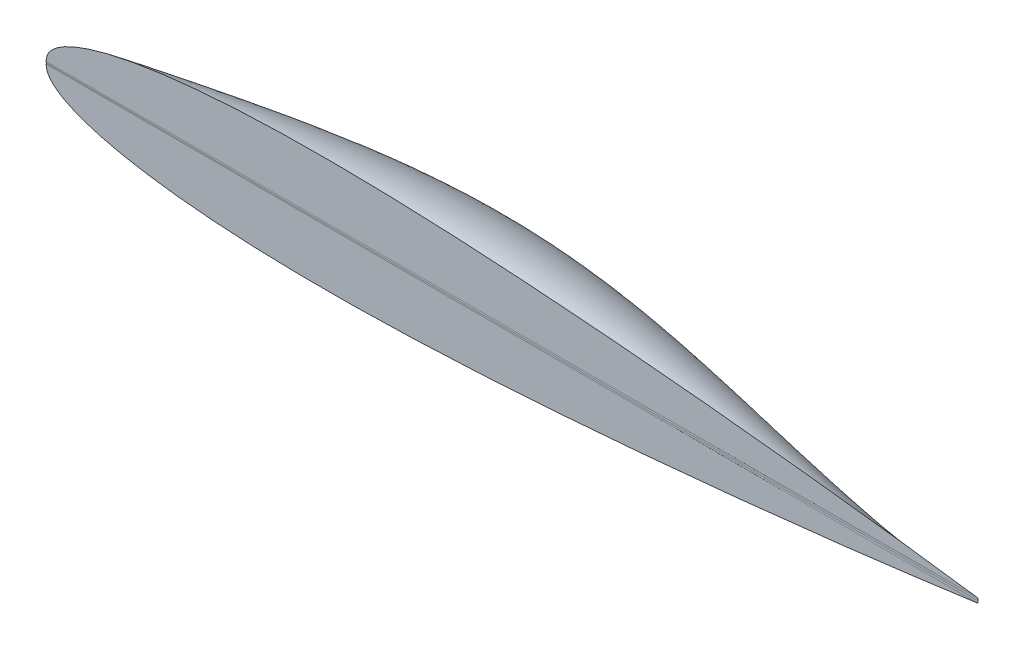
ISO-10303-21;
HEADER;
FILE_DESCRIPTION(('STEP AP214'),'2;1');
FILE_NAME('part.step','',(''),(''),'','','');
FILE_SCHEMA(('AUTOMOTIVE_DESIGN { 1 0 10303 214 1 1 1 1 }'));
ENDSEC;
DATA;
#1=APPLICATION_CONTEXT('core data for automotive mechanical design processes');
#2=APPLICATION_PROTOCOL_DEFINITION('international standard','automotive_design',2000,#1);
#3=PRODUCT_CONTEXT('',#1,'mechanical');
#4=PRODUCT('Part','Part','',(#3));
#5=PRODUCT_RELATED_PRODUCT_CATEGORY('part','',(#4));
#6=PRODUCT_DEFINITION_FORMATION('','',#4);
#7=PRODUCT_DEFINITION_CONTEXT('part definition',#1,'design');
#8=PRODUCT_DEFINITION('design','',#6,#7);
#9=PRODUCT_DEFINITION_SHAPE('','',#8);
#10=(LENGTH_UNIT() NAMED_UNIT(*) SI_UNIT(.MILLI.,.METRE.));
#11=(NAMED_UNIT(*) PLANE_ANGLE_UNIT() SI_UNIT($,.RADIAN.));
#12=(NAMED_UNIT(*) SI_UNIT($,.STERADIAN.) SOLID_ANGLE_UNIT());
#13=UNCERTAINTY_MEASURE_WITH_UNIT(LENGTH_MEASURE(1.E-05),#10,'distance_accuracy_value','');
#14=(GEOMETRIC_REPRESENTATION_CONTEXT(3) GLOBAL_UNCERTAINTY_ASSIGNED_CONTEXT((#13)) GLOBAL_UNIT_ASSIGNED_CONTEXT((#10,
#11,#12)) REPRESENTATION_CONTEXT('',''));
#15=CARTESIAN_POINT('',(0.,0.,0.));
#16=DIRECTION('',(0.,0.,1.));
#17=DIRECTION('',(1.,0.,0.));
#18=AXIS2_PLACEMENT_3D('',#15,#16,#17);
#19=CARTESIAN_POINT('',(105.570778300293,11.6825539704049,0.));
#20=DIRECTION('',(0.,0.,-1.));
#21=DIRECTION('',(-1.,0.,0.));
#22=AXIS2_PLACEMENT_3D('',#19,#20,#21);
#23=PLANE('',#22);
#24=CARTESIAN_POINT('',(214.122,0.52379372,0.));
#25=CARTESIAN_POINT('',(214.012013698939,0.539217886475698,0.));
#26=CARTESIAN_POINT('',(213.572667663683,0.60083052662156,0.));
#27=CARTESIAN_POINT('',(212.586675087422,0.738294756942449,0.));
#28=CARTESIAN_POINT('',(210.950160225861,0.965447109708674,0.));
#29=CARTESIAN_POINT('',(208.673122968684,1.27709777920002,0.));
#30=CARTESIAN_POINT('',(205.769712050775,1.66966681165039,0.));
#31=CARTESIAN_POINT('',(202.257677014697,2.13522342039783,0.));
#32=CARTESIAN_POINT('',(198.158708839794,2.66750594921198,0.));
#33=CARTESIAN_POINT('',(193.498136831207,3.25814310907295,0.));
#34=CARTESIAN_POINT('',(188.304642846765,3.89920488324123,0.));
#35=CARTESIAN_POINT('',(182.610253226035,4.58124069761384,0.));
#36=CARTESIAN_POINT('',(176.450113572536,5.29603285017793,0.));
#37=CARTESIAN_POINT('',(169.862114328083,6.03377600925147,0.));
#38=CARTESIAN_POINT('',(162.886908903615,6.78548495882012,0.));
#39=CARTESIAN_POINT('',(155.56754721965,7.54181689182033,0.));
#40=CARTESIAN_POINT('',(147.949138891376,8.29301130409345,0.));
#41=CARTESIAN_POINT('',(140.078674388622,9.02852314338117,0.));
#42=CARTESIAN_POINT('',(132.004623532784,9.7386968097675,0.));
#43=CARTESIAN_POINT('',(123.776853772673,10.4116594278778,0.));
#44=CARTESIAN_POINT('',(115.44592116191,11.0364383272202,0.));
#45=CARTESIAN_POINT('',(107.063264355394,11.6014339857743,0.));
#46=CARTESIAN_POINT('',(98.6805322459405,12.0948328326805,0.));
#47=CARTESIAN_POINT('',(90.3493308385921,12.5041697678413,0.));
#48=CARTESIAN_POINT('',(82.1211133666454,12.8185294411531,0.));
#49=CARTESIAN_POINT('',(74.0463721568433,13.0276562598862,0.));
#50=CARTESIAN_POINT('',(66.1750074544528,13.1213356782166,0.));
#51=CARTESIAN_POINT('',(58.5553855662052,13.0921332578879,0.));
#52=CARTESIAN_POINT('',(51.2344833510398,12.9344083153224,0.));
#53=CARTESIAN_POINT('',(44.2573646414449,12.6441626956519,0.));
#54=CARTESIAN_POINT('',(37.6669737764339,12.220637161581,0.));
#55=CARTESIAN_POINT('',(31.5038194993422,11.6651060734603,0.));
#56=CARTESIAN_POINT('',(25.8056026416452,10.9819081528874,0.));
#57=CARTESIAN_POINT('',(20.6070994886753,10.1768564030397,0.));
#58=CARTESIAN_POINT('',(15.9396698419597,9.25835890137933,0.));
#59=CARTESIAN_POINT('',(11.8311193789315,8.23680134436972,0.));
#60=CARTESIAN_POINT('',(8.30340848478721,7.12214519210064,0.));
#61=CARTESIAN_POINT('',(5.37861073793404,5.92477191854433,0.));
#62=CARTESIAN_POINT('',(3.05403342183633,4.65278231679485,0.));
#63=CARTESIAN_POINT('',(1.36700461460822,3.30366587168943,0.));
#64=CARTESIAN_POINT('',(0.223693908615599,1.84478439078851,0.));
#65=CARTESIAN_POINT('',(0.071109676973306,0.759691750227928,0.));
#66=CARTESIAN_POINT('',(0.,0.254,0.));
#67=B_SPLINE_CURVE_WITH_KNOTS('',3,(#24,#25,#26,#27,#28,#29,#30,#31,#32,#33,#34,#35,#36,#37,#38,
#39,#40,#41,#42,#43,#44,#45,#46,#47,#48,#49,#50,#51,#52,#53,#54,#55,#56,#57,#58,#59,#60,#61,#62,
#63,#64,#65,#66),.UNSPECIFIED.,.F.,.F.,(4,1,1,1,1,1,1,1,1,1,1,1,1,1,1,1,1,1,1,1,1,1,1,1,1,1,1,1,
1,1,1,1,1,1,1,1,1,1,1,1,4),(0.,0.00152631335854269,0.00609693858386953,0.0136813791590734,
0.0242322635210792,0.0376815848553287,0.0539454990364143,0.0729197074227606,0.0944858890420893,
0.118507109455895,0.144834528623845,0.17330204341344,0.203732644949853,0.235937910802385,
0.269715837277166,0.304856618966518,0.341143682164495,0.378349043629825,0.416244676577475,
0.454593298649091,0.493160140849374,0.531706216039987,0.569993522992586,0.607790483264524,
0.644865161858563,0.680997317886248,0.715968966978564,0.74957622859618,0.781624606496829,
0.811930012733797,0.840324886318974,0.866656529564172,0.890787206784942,0.912602342958757,
0.932007761750074,0.948944001274463,0.963392464207368,0.975407395926676,0.985166810642943,
0.993087206375709,1.),.UNSPECIFIED.);
#68=CARTESIAN_POINT('',(214.122,0.52379372,0.));
#69=VERTEX_POINT('',#68);
#70=CARTESIAN_POINT('',(0.,0.254,0.));
#71=VERTEX_POINT('',#70);
#72=EDGE_CURVE('E230',#69,#71,#67,.T.);
#73=ORIENTED_EDGE('',*,*,#72,.T.);
#74=DIRECTION('',(0.999999206200945,0.00125999899981319,0.));
#75=VECTOR('',#74,1.);
#76=CARTESIAN_POINT('',(0.,0.254,0.));
#77=LINE('',#76,#75);
#78=EDGE_CURVE('E189',#71,#69,#77,.T.);
#79=ORIENTED_EDGE('',*,*,#78,.T.);
#80=EDGE_LOOP('',(#73,#79));
#81=FACE_BOUND('',#80,.T.);
#82=ADVANCED_FACE('F163',(#81),#23,.F.);
#83=CARTESIAN_POINT('',(214.122,0.52379372,0.));
#84=CARTESIAN_POINT('',(214.123647079123,0.352027648019965,-0.00349200417026717));
#85=CARTESIAN_POINT('',(214.123926243081,0.174483524068,-0.00375544252980118));
#86=CARTESIAN_POINT('',(214.122,0.,0.));
#87=CARTESIAN_POINT('',(196.2785,0.50131091,0.));
#88=CARTESIAN_POINT('',(196.285596832413,0.351302074795193,-0.00905923341314763));
#89=CARTESIAN_POINT('',(196.286281943338,0.171895813716938,-0.0101958456102846));
#90=CARTESIAN_POINT('',(196.2785,0.,0.));
#91=CARTESIAN_POINT('',(160.5915,0.45634529,0.));
#92=CARTESIAN_POINT('',(160.635590700813,0.440677587397623,-0.0192842229093737));
#93=CARTESIAN_POINT('',(160.636646863209,0.214549933772225,-0.0263553399225617));
#94=CARTESIAN_POINT('',(160.5915,0.,0.));
#95=CARTESIAN_POINT('',(107.061,0.38889686,0.));
#96=CARTESIAN_POINT('',(107.197679388658,0.705632232338516,-0.0311697927033302));
#97=CARTESIAN_POINT('',(107.198478634457,0.348435465122919,-0.0530974624627615));
#98=CARTESIAN_POINT('',(107.061,0.,0.));
#99=CARTESIAN_POINT('',(53.5305,0.32144843,0.));
#100=CARTESIAN_POINT('',(53.7556807615356,0.959889652197988,-0.0388799405651265));
#101=CARTESIAN_POINT('',(53.7559186305134,0.478641076736908,-0.0750092826925989));
#102=CARTESIAN_POINT('',(53.5305000000001,0.,0.));
#103=CARTESIAN_POINT('',(17.8435,0.27648281,0.));
#104=CARTESIAN_POINT('',(18.0975,1.02787071463757,-0.0407540861970319));
#105=CARTESIAN_POINT('',(18.0975,0.513935357318787,-0.0815081723841509));
#106=CARTESIAN_POINT('',(17.8435000000001,0.,0.));
#107=CARTESIAN_POINT('',(0.,0.254,0.));
#108=CARTESIAN_POINT('',(0.254,1.01288217463757,-0.0407540861970319));
#109=CARTESIAN_POINT('',(0.254,0.506441087318787,-0.0815081723841509));
#110=CARTESIAN_POINT('',(0.,0.,0.));
#111=B_SPLINE_SURFACE_WITH_KNOTS('',3,3,((#83,#84,#85,#86),(#87,#88,#89,#90),(#91,#92,#93,#94),
(#95,#96,#97,#98),(#99,#100,#101,#102),(#103,#104,#105,#106),(#107,#108,#109,#110)),
.UNSPECIFIED.,.F.,.F.,.F.,(4,1,1,1,4),(4,4),(0.505364222716089,0.629023167037067,
0.752682111358045,0.876341055679022,1.),(0.,1.),.UNSPECIFIED.);
#112=CARTESIAN_POINT('',(0.,0.254,0.));
#113=CARTESIAN_POINT('',(0.254,1.01288217463757,-0.0407540861970319));
#114=CARTESIAN_POINT('',(0.254,0.506441087318787,-0.0815081723841509));
#115=CARTESIAN_POINT('',(0.,0.,0.));
#116=B_SPLINE_CURVE_WITH_KNOTS('',3,(#112,#113,#114,#115),.UNSPECIFIED.,.F.,.F.,(4,4),(0.,1.),.UNSPECIFIED.);
#117=CARTESIAN_POINT('',(0.,0.,0.));
#118=VERTEX_POINT('',#117);
#119=EDGE_CURVE('E314',#71,#118,#116,.T.);
#120=DIRECTION('',(-1.,0.,0.));
#121=VECTOR('',#120,1.);
#122=CARTESIAN_POINT('',(214.122,0.,0.));
#123=LINE('',#122,#121);
#124=CARTESIAN_POINT('',(214.122,0.,0.));
#125=VERTEX_POINT('',#124);
#126=EDGE_CURVE('E13',#125,#118,#123,.T.);
#127=CARTESIAN_POINT('',(214.122,0.52379372,0.));
#128=CARTESIAN_POINT('',(214.123647079123,0.352027648019965,-0.00349200417026717));
#129=CARTESIAN_POINT('',(214.123926243081,0.174483524068,-0.00375544252980118));
#130=CARTESIAN_POINT('',(214.122,0.,0.));
#131=B_SPLINE_CURVE_WITH_KNOTS('',3,(#127,#128,#129,#130),.UNSPECIFIED.,.F.,.F.,(4,4),(0.,1.),.UNSPECIFIED.);
#132=EDGE_CURVE('E182',#69,#125,#131,.T.);
#133=ORIENTED_EDGE('',*,*,#78,.F.);
#134=ORIENTED_EDGE('',*,*,#119,.T.);
#135=ORIENTED_EDGE('',*,*,#126,.F.);
#136=ORIENTED_EDGE('',*,*,#132,.F.);
#137=EDGE_LOOP('',(#133,#134,#135,#136));
#138=FACE_BOUND('',#137,.T.);
#139=ADVANCED_FACE('F165',(#138),#111,.T.);
#140=CARTESIAN_POINT('',(0.,0.254,0.));
#141=CARTESIAN_POINT('',(0.254,1.01288217463757,-0.0407540861970319));
#142=CARTESIAN_POINT('',(0.254,0.506441087318787,-0.0815081723841509));
#143=CARTESIAN_POINT('',(0.,0.,0.));
#144=CARTESIAN_POINT('',(0.0381090826463986,0.525010213001986,0.));
#145=CARTESIAN_POINT('',(0.361505434330713,1.19355564997223,-0.0803296088588077));
#146=CARTESIAN_POINT('',(0.430901786015028,0.596777824986116,-0.160659217707703));
#147=CARTESIAN_POINT('',(0.246298137699342,0.,-0.118726567985327));
#148=CARTESIAN_POINT('',(0.11196928056709,1.06728909146758,0.));
#149=CARTESIAN_POINT('',(0.575036263251403,1.55545714221049,-0.159631199096487));
#150=CARTESIAN_POINT('',(0.784134245368324,0.777466316903765,-0.319209460897628));
#151=CARTESIAN_POINT('',(0.73926326855616,0.,-0.355360337351549));
#152=CARTESIAN_POINT('',(0.346490962371463,1.86055979332808,0.));
#153=CARTESIAN_POINT('',(0.978096315514759,2.08600643339264,-0.27901125975937));
#154=CARTESIAN_POINT('',(1.35587071275709,1.0415731089578,-0.557733836886613));
#155=CARTESIAN_POINT('',(1.47981438001347,0.,-0.707840564557713));
#156=CARTESIAN_POINT('',(0.788114326374681,2.56093657206352,0.));
#157=CARTESIAN_POINT('',(1.51950077825554,2.55573731614122,-0.398795036292593));
#158=CARTESIAN_POINT('',(1.99728441163905,1.27450851492987,-0.796911777655328));
#159=CARTESIAN_POINT('',(2.22146575544055,0.,-1.05783803789084));
#160=CARTESIAN_POINT('',(1.33064627147708,3.17749840449483,0.));
#161=CARTESIAN_POINT('',(2.12845465415207,2.97068451860329,-0.518958569260136));
#162=CARTESIAN_POINT('',(2.67297699569021,1.47930218926313,-1.0366978367794));
#163=CARTESIAN_POINT('',(2.96421424363508,0.,-1.40534043032107));
#164=CARTESIAN_POINT('',(1.93151892852171,3.73966040267236,0.));
#165=CARTESIAN_POINT('',(2.77657976717781,3.3504401924122,-0.639477899225976));
#166=CARTESIAN_POINT('',(3.36875852923413,1.66576249814387,-1.27704656783447));
#167=CARTESIAN_POINT('',(3.70805669339474,0.,-1.75033541481854));
#168=CARTESIAN_POINT('',(2.79268039153915,4.41740036881898,0.));
#169=CARTESIAN_POINT('',(3.68111564151185,3.81031765358511,-0.800612789263464));
#170=CARTESIAN_POINT('',(4.31732174679585,1.89017744369031,-1.59820117658339));
#171=CARTESIAN_POINT('',(4.70130104022473,0.,-2.20696908086499));
#172=CARTESIAN_POINT('',(3.95093575530103,5.15200290992472,0.));
#173=CARTESIAN_POINT('',(4.86701676439924,4.3127141557885,-1.00280109712596));
#174=CARTESIAN_POINT('',(5.53189549773744,2.13268841252531,-2.00082388522518));
#175=CARTESIAN_POINT('',(5.94557562166347,0.,-2.7714310084418));
#176=CARTESIAN_POINT('',(5.41481646876265,5.9005754308248,0.));
#177=CARTESIAN_POINT('',(6.34053046774949,4.83096961380858,-1.2464669035778));
#178=CARTESIAN_POINT('',(7.01659993791192,2.37863764422566,-2.4854946805294));
#179=CARTESIAN_POINT('',(7.44303054641345,0.,-3.43855845732506));
#180=CARTESIAN_POINT('',(6.9219583202896,6.55770088509275,0.));
#181=CARTESIAN_POINT('',(7.84400432835519,5.29213031719936,-1.49098087155831));
#182=CARTESIAN_POINT('',(8.51827743651064,2.59338406297872,-2.97132544937275));
#183=CARTESIAN_POINT('',(8.94478568856841,0.,-4.09536042576048));
#184=CARTESIAN_POINT('',(8.45980988625408,7.13902030155212,0.));
#185=CARTESIAN_POINT('',(9.36907395775592,5.70648023397475,-1.73615132557931));
#186=CARTESIAN_POINT('',(10.0327390179981,2.78216797574848,-3.45795262036028));
#187=CARTESIAN_POINT('',(10.4508158385098,0.,-4.74173829750912));
#188=CARTESIAN_POINT('',(10.0186088974503,7.6619310124359,0.));
#189=CARTESIAN_POINT('',(10.9092344037726,6.08547420108831,-1.98178659015264));
#190=CARTESIAN_POINT('',(11.5567254249793,2.95081512396875,-3.94501262209705));
#191=CARTESIAN_POINT('',(11.9610957866191,0.,-5.37759345633207));
#192=CARTESIAN_POINT('',(11.5936917425916,8.13394607610787,0.));
#193=CARTESIAN_POINT('',(12.4613798195056,6.43397753958079,-2.22769498979011));
#194=CARTESIAN_POINT('',(13.088676952699,3.10185649111693,-4.43214188318809));
#195=CARTESIAN_POINT('',(13.4756003232778,0.,-6.00282728599039));
#196=CARTESIAN_POINT('',(13.180601391522,8.56502505460345,0.));
#197=CARTESIAN_POINT('',(14.0225403818956,6.75848657294067,-2.47367477797408));
#198=CARTESIAN_POINT('',(14.6270993629525,3.2386385618943,-4.91895669017951));
#199=CARTESIAN_POINT('',(14.9942991481274,0.,-6.6173109571567));
#200=CARTESIAN_POINT('',(14.7771717159238,8.95947633476784,0.));
#201=CARTESIAN_POINT('',(15.5912735357758,7.06173017452968,-2.71952420818688));
#202=CARTESIAN_POINT('',(16.1712620514807,3.36262409593872,-5.40507332961737));
#203=CARTESIAN_POINT('',(16.5171619608094,0.,-7.22091564050362));
#204=CARTESIAN_POINT('',(16.3813844211275,9.32221346420766,0.));
#205=CARTESIAN_POINT('',(17.1662352817446,7.34684065821708,-2.96504153391086));
#206=CARTESIAN_POINT('',(17.7204836919077,3.47547757314188,-5.89010808804778));
#207=CARTESIAN_POINT('',(18.0441584609654,0.,-7.81351250670378));
#208=CARTESIAN_POINT('',(17.991772874025,9.65718469683624,0.));
#209=CARTESIAN_POINT('',(18.7464493947746,7.61630680874336,-3.21002500862836));
#210=CARTESIAN_POINT('',(19.2742668450444,3.57854170883104,-6.37367725201681));
#211=CARTESIAN_POINT('',(19.5752583482367,0.,-8.39497272642979));
#212=CARTESIAN_POINT('',(19.6074176468335,9.9665224990101,0.));
#213=CARTESIAN_POINT('',(20.3313044533887,7.87140688581105,-3.45427288582172));
#214=CARTESIAN_POINT('',(20.8322964734769,3.6725539558145,-6.85539710807054));
#215=CARTESIAN_POINT('',(21.110431322265,0.,-8.96516747035427));
#216=CARTESIAN_POINT('',(21.2273720133654,10.2531233383422,0.));
#217=CARTESIAN_POINT('',(21.9201708371735,8.11392848329368,-3.69758341897328));
#218=CARTESIAN_POINT('',(22.3942484403231,3.75850643398605,-7.33488394275507));
#219=CARTESIAN_POINT('',(22.6496470826917,0.,-9.52396790914984));
#220=CARTESIAN_POINT('',(23.3922131551321,10.6074448276271,0.));
#221=CARTESIAN_POINT('',(24.0434470639024,8.42199678597555,-4.02047867576276));
#222=CARTESIAN_POINT('',(24.4817880524966,3.86323321648415,-7.97071074257027));
#223=CARTESIAN_POINT('',(24.7072847446472,0.,-10.2536709816022));
#224=CARTESIAN_POINT('',(26.1061051778331,11.0021444664508,0.));
#225=CARTESIAN_POINT('',(26.7056227195865,8.78067916557105,-4.42074565405682));
#226=CARTESIAN_POINT('',(27.0999978100444,3.97700548746504,-8.75799312164666));
#227=CARTESIAN_POINT('',(27.2892872862952,0.,-11.1366699127085));
#228=CARTESIAN_POINT('',(29.371934843579,11.4102071753902,0.));
#229=CARTESIAN_POINT('',(29.9108798089484,9.17540394599577,-4.89401594297691));
#230=CARTESIAN_POINT('',(30.254634056982,4.09017622633208,-9.68751494663269));
#231=CARTESIAN_POINT('',(30.4032644963339,0.,-12.1484118465331));
#232=CARTESIAN_POINT('',(32.6446990064181,11.7605612709204,0.));
#233=CARTESIAN_POINT('',(33.1252748896695,9.5385330712096,-5.35854941013987));
#234=CARTESIAN_POINT('',(33.4211699829078,4.18282677248482,-10.5986045049156));
#235=CARTESIAN_POINT('',(33.532461283769,0.,-13.1110480684865));
#236=CARTESIAN_POINT('',(35.9226457133065,12.0601023586168,0.));
#237=CARTESIAN_POINT('',(36.3476148428133,9.87351653531526,-5.81265931882136));
#238=CARTESIAN_POINT('',(36.5988783250525,4.25746870663084,-11.4880465596979));
#239=CARTESIAN_POINT('',(36.6765230659359,0.,-14.0233296502004));
#240=CARTESIAN_POINT('',(39.2045336441411,12.3137763051662,0.));
#241=CARTESIAN_POINT('',(39.5770469714038,10.1825045064897,-6.25465893229703));
#242=CARTESIAN_POINT('',(39.7872020316269,4.31596369651484,-12.352625874182));
#243=CARTESIAN_POINT('',(39.8350952601697,0.,-14.8840076633065));
#244=CARTESIAN_POINT('',(42.4893302802324,12.5261108606937,0.));
#245=CARTESIAN_POINT('',(42.8128003532695,10.4673684085356,-6.68277390563575));
#246=CARTESIAN_POINT('',(42.9855387990373,4.36003403769436,-13.188951995157));
#247=CARTESIAN_POINT('',(43.0076510053921,0.,-15.6915703548161));
#248=CARTESIAN_POINT('',(45.7762453797207,12.7006905821514,0.));
#249=CARTESIAN_POINT('',(46.0542655841252,10.7293508698068,-7.09522989390634));
#250=CARTESIAN_POINT('',(46.1933670826331,4.39108762800254,-13.9936344694116));
#251=CARTESIAN_POINT('',(46.1936634405243,0.,-16.4445059717404));
#252=CARTESIAN_POINT('',(49.0646169051743,12.8407469675558,0.));
#253=CARTESIAN_POINT('',(49.3009187293048,10.9694591460333,-7.49025255217766));
#254=CARTESIAN_POINT('',(49.410208072573,4.41041467896065,-14.7632828437349));
#255=CARTESIAN_POINT('',(49.3926057044877,0.,-17.1413027610908));
#256=CARTESIAN_POINT('',(52.3539062785437,12.948902079042,0.));
#257=CARTESIAN_POINT('',(52.5523181603966,11.1882942023577,-7.86606753551855));
#258=CARTESIAN_POINT('',(52.6356241121433,4.41910225679616,-15.4945066649155));
#259=CARTESIAN_POINT('',(52.6039509362038,0.,-17.7804489698786));
#260=CARTESIAN_POINT('',(56.740253627681,13.0537745746271,0.));
#261=CARTESIAN_POINT('',(56.8932072039856,11.4523143573203,-8.33912460278797));
#262=CARTESIAN_POINT('',(56.9468067149007,4.41785069448819,-16.4136113166122));
#263=CARTESIAN_POINT('',(56.9011851808086,0.,-18.5536001514181));
#264=CARTESIAN_POINT('',(62.2233638150086,13.116608609635,0.));
#265=CARTESIAN_POINT('',(62.3288661705431,11.7310855200787,-8.87335420975668));
#266=CARTESIAN_POINT('',(62.3542402161869,4.39458498648304,-17.4490768520487));
#267=CARTESIAN_POINT('',(62.2996228258707,0.,-19.3677514665835));
#268=CARTESIAN_POINT('',(68.8009037849743,13.0972997215375,0.));
#269=CARTESIAN_POINT('',(68.8638349280154,11.9840950589969,-9.40856691106307));
#270=CARTESIAN_POINT('',(68.8682223236077,4.33848209449442,-18.4824048137527));
#271=CARTESIAN_POINT('',(68.814199614714,0.,-20.0880148494042));
#272=CARTESIAN_POINT('',(75.3743867959028,12.9946389745347,0.));
#273=CARTESIAN_POINT('',(75.4076657162736,12.1539840454109,-9.82167439907549));
#274=CARTESIAN_POINT('',(75.4017552839587,4.25968548131688,-19.2752832153709));
#275=CARTESIAN_POINT('',(75.3567764707495,0.,-20.5333231325714));
#276=CARTESIAN_POINT('',(81.942312595212,12.8183423869433,0.));
#277=CARTESIAN_POINT('',(81.9561543576801,12.238053214618,-10.1031965499328));
#278=CARTESIAN_POINT('',(81.9471871710252,4.16313818384897,-19.8100177023903));
#279=CARTESIAN_POINT('',(81.9155083106855,0.,-20.7057261989395));
#280=CARTESIAN_POINT('',(88.5034796782284,12.5771371596043,0.));
#281=CARTESIAN_POINT('',(88.5061828309719,12.2329440902654,-10.2503801005464));
#282=CARTESIAN_POINT('',(88.4987396234328,4.05345363316398,-20.0823676418434));
#283=CARTESIAN_POINT('',(88.4812110245367,0.,-20.6274545136806));
#284=CARTESIAN_POINT('',(95.0568703135925,12.2779339265216,0.));
#285=CARTESIAN_POINT('',(95.0547556304287,12.134087151442,-10.2604717878276));
#286=CARTESIAN_POINT('',(95.0506955375786,3.93463973805618,-20.0880924007624));
#287=CARTESIAN_POINT('',(95.0447005023178,0.,-20.3207385419666));
#288=CARTESIAN_POINT('',(99.4200040940058,12.0436794231662,0.));
#289=CARTESIAN_POINT('',(99.418655962587,12.0021526796561,-10.1739472082611));
#290=CARTESIAN_POINT('',(99.4173594140356,3.85177370640736,-19.911287124094));
#291=CARTESIAN_POINT('',(99.4160807277832,0.,-19.9787184862155));
#292=CARTESIAN_POINT('',(110.12658886745,11.4300043604416,0.));
#293=CARTESIAN_POINT('',(110.131574160365,11.5924383602098,-9.84470424636731));
#294=CARTESIAN_POINT('',(110.136645162431,3.64661656847562,-19.2518369605012));
#295=CARTESIAN_POINT('',(110.141645432631,0.,-18.9881025464891));
#296=CARTESIAN_POINT('',(127.130707155448,10.2182299649809,0.));
#297=CARTESIAN_POINT('',(127.14172107951,10.2887982219567,-8.56694518647266));
#298=CARTESIAN_POINT('',(127.152670729053,3.26388561497301,-16.7515386609131));
#299=CARTESIAN_POINT('',(127.163669203207,0.,-16.4746267496151));
#300=CARTESIAN_POINT('',(152.533845143874,7.90694004660489,0.));
#301=CARTESIAN_POINT('',(152.512774598207,7.26119842390852,-5.48673700853106));
#302=CARTESIAN_POINT('',(152.4912254869,2.55766617952122,-10.7583329864254));
#303=CARTESIAN_POINT('',(152.470179438551,0.,-11.1980636247076));
#304=CARTESIAN_POINT('',(177.877712147182,5.19456444821615,0.));
#305=CARTESIAN_POINT('',(177.827520252734,3.96461615593605,-2.30389051675642));
#306=CARTESIAN_POINT('',(177.776669886628,1.7161483592118,-4.55834570707987));
#307=CARTESIAN_POINT('',(177.72654463093,0.,-5.60910489374326));
#308=CARTESIAN_POINT('',(194.758649363254,3.12257981123613,0.));
#309=CARTESIAN_POINT('',(194.731855582482,2.08431849017189,-0.82182581112098));
#310=CARTESIAN_POINT('',(194.704722116585,1.04347434216267,-1.64642616162679));
#311=CARTESIAN_POINT('',(194.677968935775,0.,-2.47375083053153));
#312=CARTESIAN_POINT('',(204.104906057734,1.89026374203427,0.));
#313=CARTESIAN_POINT('',(204.107778323119,1.2598972592162,-0.386993049446666));
#314=CARTESIAN_POINT('',(204.110687009008,0.629807652251057,-0.773688670485643));
#315=CARTESIAN_POINT('',(204.113555086343,0.,-1.16009222481032));
#316=CARTESIAN_POINT('',(205.920648790209,1.64901850436244,0.));
#317=CARTESIAN_POINT('',(205.925669384807,1.09877579600561,-0.306018031373904));
#318=CARTESIAN_POINT('',(205.930721505469,0.548971860714251,-0.611158323862154));
#319=CARTESIAN_POINT('',(205.935577565847,0.,-0.915400184180546));
#320=CARTESIAN_POINT('',(208.65472991206,1.27976507142243,0.));
#321=CARTESIAN_POINT('',(208.657217386552,0.852948134344194,-0.194370146639401));
#322=CARTESIAN_POINT('',(208.659501543678,0.425665744980325,-0.387034927343155));
#323=CARTESIAN_POINT('',(208.661140075205,0.,-0.577826808447985));
#324=CARTESIAN_POINT('',(211.391803193148,0.904907997801673,0.));
#325=CARTESIAN_POINT('',(211.390971630934,0.604143711131503,-0.0927941662198667));
#326=CARTESIAN_POINT('',(211.38948007534,0.300891174111122,-0.18309737777576));
#327=CARTESIAN_POINT('',(211.386682402662,0.,-0.270490198875533));
#328=CARTESIAN_POINT('',(213.213295217072,0.651227897838334,0.));
#329=CARTESIAN_POINT('',(213.213093561628,0.436250337531692,-0.0320417854929556));
#330=CARTESIAN_POINT('',(213.211783353194,0.216709278660427,-0.0610963824873091));
#331=CARTESIAN_POINT('',(213.208589723603,0.,-0.0865081767137248));
#332=CARTESIAN_POINT('',(214.122,0.52379372,0.));
#333=CARTESIAN_POINT('',(214.123647079123,0.352027648019965,-0.00349200417026717));
#334=CARTESIAN_POINT('',(214.123926243081,0.174483524068,-0.00375544252980118));
#335=CARTESIAN_POINT('',(214.122,0.,0.));
#336=B_SPLINE_SURFACE_WITH_KNOTS('',3,3,((#140,#141,#142,#143),(#144,#145,#146,#147),(#148,#149,
#150,#151),(#152,#153,#154,#155),(#156,#157,#158,#159),(#160,#161,#162,#163),(#164,#165,#166,
#167),(#168,#169,#170,#171),(#172,#173,#174,#175),(#176,#177,#178,#179),(#180,#181,#182,#183),
(#184,#185,#186,#187),(#188,#189,#190,#191),(#192,#193,#194,#195),(#196,#197,#198,#199),(#200,
#201,#202,#203),(#204,#205,#206,#207),(#208,#209,#210,#211),(#212,#213,#214,#215),(#216,#217,
#218,#219),(#220,#221,#222,#223),(#224,#225,#226,#227),(#228,#229,#230,#231),(#232,#233,#234,
#235),(#236,#237,#238,#239),(#240,#241,#242,#243),(#244,#245,#246,#247),(#248,#249,#250,#251),
(#252,#253,#254,#255),(#256,#257,#258,#259),(#260,#261,#262,#263),(#264,#265,#266,#267),(#268,
#269,#270,#271),(#272,#273,#274,#275),(#276,#277,#278,#279),(#280,#281,#282,#283),(#284,#285,
#286,#287),(#288,#289,#290,#291),(#292,#293,#294,#295),(#296,#297,#298,#299),(#300,#301,#302,
#303),(#304,#305,#306,#307),(#308,#309,#310,#311),(#312,#313,#314,#315),(#316,#317,#318,#319),
(#320,#321,#322,#323),(#324,#325,#326,#327),(#328,#329,#330,#331),(#332,#333,#334,#335)),
.UNSPECIFIED.,.F.,.F.,.F.,(4,1,1,1,1,1,1,1,1,1,1,1,1,1,1,1,1,1,1,1,1,1,1,1,1,1,1,1,1,1,1,1,1,1,
1,1,2,1,1,1,2,1,1,1,4),(4,4),(0.,0.00189577690357129,0.00379155380714257,0.00568733071071386,
0.00758310761428515,0.00947888451785643,0.0113746614214277,0.0151662152285703,
0.0189577690357129,0.0227493228428554,0.026540876649998,0.0303324304571406,0.0341239842642832,
0.0379155380714257,0.0417070918785683,0.0454986456857109,0.0492901994928535,0.053081753299996,
0.0568733071071386,0.0606648609142812,0.0682479685285663,0.0758310761428515,0.0834141837571366,
0.0909972913714218,0.098580398985707,0.106163506599992,0.113746614214277,0.121329721828562,
0.128912829442848,0.136495937057133,0.151662152285703,0.166828367514273,0.181994582742844,
0.197160797971414,0.212327013199984,0.227493228428554,0.242659443657125,0.301976858854073,
0.36129427405102,0.420611689247968,0.479929104444916,0.486287884012709,0.492646663580503,
0.499005443148296,0.505364222716089),(0.,1.),.UNSPECIFIED.);
#337=CARTESIAN_POINT('',(0.,0.,0.));
#338=CARTESIAN_POINT('',(22.5229130839041,0.,-10.857037720472));
#339=CARTESIAN_POINT('',(94.6542495164768,0.,-33.5136062824597));
#340=CARTESIAN_POINT('',(168.060672015961,0.,-4.36242245558186));
#341=CARTESIAN_POINT('',(214.122,0.,0.));
#342=B_SPLINE_CURVE_WITH_KNOTS('',3,(#337,#338,#339,#340,#341),.UNSPECIFIED.,.F.,.F.,(4,1,4),
(0.,0.344618977671112,1.),.UNSPECIFIED.);
#343=EDGE_CURVE('E170',#118,#125,#342,.T.);
#344=ORIENTED_EDGE('',*,*,#72,.F.);
#345=ORIENTED_EDGE('',*,*,#132,.T.);
#346=ORIENTED_EDGE('',*,*,#343,.F.);
#347=ORIENTED_EDGE('',*,*,#119,.F.);
#348=EDGE_LOOP('',(#344,#345,#346,#347));
#349=FACE_BOUND('',#348,.T.);
#350=ADVANCED_FACE('F335',(#349),#336,.T.);
#351=CARTESIAN_POINT('',(105.570778300293,-11.6825539704049,0.));
#352=DIRECTION('',(0.,0.,-1.));
#353=DIRECTION('',(-1.,0.,0.));
#354=AXIS2_PLACEMENT_3D('',#351,#352,#353);
#355=PLANE('',#354);
#356=CARTESIAN_POINT('',(0.,-0.254,0.));
#357=CARTESIAN_POINT('',(0.0711096769733066,-0.759691750227928,0.));
#358=CARTESIAN_POINT('',(0.223693908615602,-1.84478439078852,0.));
#359=CARTESIAN_POINT('',(1.36700461460822,-3.30366587168943,0.));
#360=CARTESIAN_POINT('',(3.05403342183633,-4.65278231679485,0.));
#361=CARTESIAN_POINT('',(5.37861073793402,-5.92477191854432,0.));
#362=CARTESIAN_POINT('',(8.30340848478723,-7.12214519210065,0.));
#363=CARTESIAN_POINT('',(11.8311193789315,-8.23680134436972,0.));
#364=CARTESIAN_POINT('',(15.9396698419597,-9.25835890137933,0.));
#365=CARTESIAN_POINT('',(20.6070994886753,-10.1768564030397,0.));
#366=CARTESIAN_POINT('',(25.8056026416452,-10.9819081528874,0.));
#367=CARTESIAN_POINT('',(31.5038194993422,-11.6651060734603,0.));
#368=CARTESIAN_POINT('',(37.6669737764339,-12.220637161581,0.));
#369=CARTESIAN_POINT('',(44.2573646414449,-12.644162695652,0.));
#370=CARTESIAN_POINT('',(51.2344833510398,-12.9344083153224,0.));
#371=CARTESIAN_POINT('',(58.5553855662051,-13.0921332578879,0.));
#372=CARTESIAN_POINT('',(66.1750074544529,-13.1213356782166,0.));
#373=CARTESIAN_POINT('',(74.0463721568433,-13.0276562598862,0.));
#374=CARTESIAN_POINT('',(82.1211133666454,-12.8185294411531,0.));
#375=CARTESIAN_POINT('',(90.3493308385922,-12.5041697678413,0.));
#376=CARTESIAN_POINT('',(98.6805322459405,-12.0948328326805,0.));
#377=CARTESIAN_POINT('',(107.063264355394,-11.6014339857743,0.));
#378=CARTESIAN_POINT('',(115.44592116191,-11.0364383272202,0.));
#379=CARTESIAN_POINT('',(123.776853772673,-10.4116594278778,0.));
#380=CARTESIAN_POINT('',(132.004623532784,-9.73869680976751,0.));
#381=CARTESIAN_POINT('',(140.078674388622,-9.02852314338117,0.));
#382=CARTESIAN_POINT('',(147.949138891376,-8.29301130409345,0.));
#383=CARTESIAN_POINT('',(155.56754721965,-7.54181689182033,0.));
#384=CARTESIAN_POINT('',(162.886908903615,-6.78548495882012,0.));
#385=CARTESIAN_POINT('',(169.862114328083,-6.03377600925146,0.));
#386=CARTESIAN_POINT('',(176.450113572536,-5.29603285017793,0.));
#387=CARTESIAN_POINT('',(182.610253226035,-4.58124069761383,0.));
#388=CARTESIAN_POINT('',(188.304642846765,-3.89920488324123,0.));
#389=CARTESIAN_POINT('',(193.498136831207,-3.25814310907295,0.));
#390=CARTESIAN_POINT('',(198.158708839794,-2.66750594921198,0.));
#391=CARTESIAN_POINT('',(202.257677014697,-2.13522342039783,0.));
#392=CARTESIAN_POINT('',(205.769712050775,-1.66966681165039,0.));
#393=CARTESIAN_POINT('',(208.673122968684,-1.27709777920002,0.));
#394=CARTESIAN_POINT('',(210.950160225861,-0.965447109708675,0.));
#395=CARTESIAN_POINT('',(212.586675087422,-0.738294756942445,0.));
#396=CARTESIAN_POINT('',(213.572667663684,-0.600830526621565,0.));
#397=CARTESIAN_POINT('',(214.012013698939,-0.539217886475699,0.));
#398=CARTESIAN_POINT('',(214.122,-0.52379372,0.));
#399=B_SPLINE_CURVE_WITH_KNOTS('',3,(#356,#357,#358,#359,#360,#361,#362,#363,#364,#365,#366,
#367,#368,#369,#370,#371,#372,#373,#374,#375,#376,#377,#378,#379,#380,#381,#382,#383,#384,#385,
#386,#387,#388,#389,#390,#391,#392,#393,#394,#395,#396,#397,#398),.UNSPECIFIED.,.F.,.F.,(4,1,1,
1,1,1,1,1,1,1,1,1,1,1,1,1,1,1,1,1,1,1,1,1,1,1,1,1,1,1,1,1,1,1,1,1,1,1,1,1,4),(0.,
0.00691279362429097,0.0148331893570567,0.0245926040733234,0.0366075357926322,0.0510559987255373,
0.067992238249926,0.0873976570412431,0.109212793215058,0.133343470435828,0.159675113681026,
0.188069987266203,0.218375393503171,0.25042377140382,0.284031033021436,0.319002682113752,
0.355134838141437,0.392209516735476,0.430006477007414,0.468293783960013,0.506839859150626,
0.545406701350909,0.583755323422525,0.621650956370175,0.658856317835505,0.695143381033482,
0.730284162722834,0.764062089197615,0.796267355050147,0.82669795658656,0.855165471376155,
0.881492890544105,0.905514110957911,0.927080292577239,0.946054500963586,0.962318415144671,
0.975767736478921,0.986318620840927,0.99390306141613,0.998473686641457,1.),.UNSPECIFIED.);
#400=CARTESIAN_POINT('',(0.,-0.254,0.));
#401=VERTEX_POINT('',#400);
#402=CARTESIAN_POINT('',(214.122,-0.52379372,0.));
#403=VERTEX_POINT('',#402);
#404=EDGE_CURVE('E209',#401,#403,#399,.T.);
#405=ORIENTED_EDGE('',*,*,#404,.T.);
#406=DIRECTION('',(-0.999999206200945,0.00125999899981319,0.));
#407=VECTOR('',#406,1.);
#408=CARTESIAN_POINT('',(0.,-0.254,0.));
#409=LINE('',#408,#407);
#410=EDGE_CURVE('E205',#403,#401,#409,.T.);
#411=ORIENTED_EDGE('',*,*,#410,.T.);
#412=EDGE_LOOP('',(#405,#411));
#413=FACE_BOUND('',#412,.T.);
#414=ADVANCED_FACE('F208',(#413),#355,.F.);
#415=CARTESIAN_POINT('',(214.122,-0.52379372,0.));
#416=CARTESIAN_POINT('',(214.123647082528,-0.352027646917197,-0.0034920038293826));
#417=CARTESIAN_POINT('',(214.123926244765,-0.174483523679933,-0.00375544219264967));
#418=CARTESIAN_POINT('',(214.122,0.,0.));
#419=CARTESIAN_POINT('',(213.21329521447,-0.651227898203239,0.));
#420=CARTESIAN_POINT('',(213.213093562428,-0.43625033664086,-0.0320417852600907));
#421=CARTESIAN_POINT('',(213.211783352268,-0.216709278366079,-0.0610963823403428));
#422=CARTESIAN_POINT('',(213.208589720987,0.,-0.0865081769614921));
#423=CARTESIAN_POINT('',(211.3918031949,-0.904907997548756,0.));
#424=CARTESIAN_POINT('',(211.390971661174,-0.604143709766461,-0.0927941802807863));
#425=CARTESIAN_POINT('',(211.389480128938,-0.300891173554507,-0.183097406163258));
#426=CARTESIAN_POINT('',(211.38668247965,0.,-0.270490241847712));
#427=CARTESIAN_POINT('',(208.65472993064,-1.27976506888523,0.));
#428=CARTESIAN_POINT('',(208.657217595328,-0.852948131363946,-0.194370102641898));
#429=CARTESIAN_POINT('',(208.659501937524,-0.425665743576338,-0.387034839529881));
#430=CARTESIAN_POINT('',(208.661140654143,0.,-0.577826676996187));
#431=CARTESIAN_POINT('',(205.920648816906,-1.64901850078614,0.));
#432=CARTESIAN_POINT('',(205.925669209264,-1.09877579224153,-0.306018068143405));
#433=CARTESIAN_POINT('',(205.930721122566,-0.548971858876515,-0.611158397494614));
#434=CARTESIAN_POINT('',(205.935576975595,0.,-0.915400294767495));
#435=CARTESIAN_POINT('',(204.104906071682,-1.8902637401951,0.));
#436=CARTESIAN_POINT('',(204.107778341833,-1.25989725655039,-0.386993048578748));
#437=CARTESIAN_POINT('',(204.110687027375,-0.62980765093316,-0.77368866878146));
#438=CARTESIAN_POINT('',(204.113555104367,0.,-1.16009222230095));
#439=CARTESIAN_POINT('',(194.758649364764,-3.12257981103829,0.));
#440=CARTESIAN_POINT('',(194.73185559289,-2.08431848823722,-0.821825810638236));
#441=CARTESIAN_POINT('',(194.704722130825,-1.04347434102665,-1.6464261603054));
#442=CARTESIAN_POINT('',(194.677968953799,0.,-2.47375082802218));
#443=CARTESIAN_POINT('',(177.877687954861,-5.19456752530911,0.));
#444=CARTESIAN_POINT('',(177.827515557258,-3.96461764298499,-2.30388965739624));
#445=CARTESIAN_POINT('',(177.776679790976,-1.71614891447225,-4.55834338339198));
#446=CARTESIAN_POINT('',(177.726569079448,0.,-5.60910050432706));
#447=CARTESIAN_POINT('',(152.533766406682,-7.90694809051535,0.));
#448=CARTESIAN_POINT('',(152.512761447905,-7.26120181654135,-5.48673303125599));
#449=CARTESIAN_POINT('',(152.491258334449,-2.55766726484643,-10.7583230674658));
#450=CARTESIAN_POINT('',(152.470258103315,0.,-11.1980458112145));
#451=CARTESIAN_POINT('',(127.130609704388,-10.2182379220854,0.));
#452=CARTESIAN_POINT('',(127.141711541456,-10.2888007130966,-8.56694153338575));
#453=CARTESIAN_POINT('',(127.152714790891,-3.26388610892998,-16.7515289375385));
#454=CARTESIAN_POINT('',(127.163766642689,0.,-16.4746085529702));
#455=CARTESIAN_POINT('',(110.12653973951,-11.4300071763336,0.));
#456=CARTESIAN_POINT('',(110.131583937322,-11.5924379853419,-9.84470394588952));
#457=CARTESIAN_POINT('',(110.136674575107,-3.64661600554424,-19.2518351510342));
#458=CARTESIAN_POINT('',(110.141694369914,0.,-18.988098026629));
#459=CARTESIAN_POINT('',(99.4199919944875,-12.0436801166809,0.));
#460=CARTESIAN_POINT('',(99.4186781800882,-12.0021518290015,-10.1739465254447));
#461=CARTESIAN_POINT('',(99.4173766258448,-3.85177337698943,-19.911286065224));
#462=CARTESIAN_POINT('',(99.4160929621053,0.,-19.9787173562503));
#463=CARTESIAN_POINT('',(95.0568408086619,-12.2779372229515,0.));
#464=CARTESIAN_POINT('',(95.0547724798696,-12.1340883805257,-10.260470205945));
#465=CARTESIAN_POINT('',(95.0507197068376,-3.93464061551471,-20.0880900805948));
#466=CARTESIAN_POINT('',(95.0447320689573,0.,-20.3207363221499));
#467=CARTESIAN_POINT('',(88.5034328614147,-12.5771381542128,0.));
#468=CARTESIAN_POINT('',(88.5061924822334,-12.2329442030958,-10.2503781566568));
#469=CARTESIAN_POINT('',(88.4987679540199,-4.05345413813131,-20.0823651944115));
#470=CARTESIAN_POINT('',(88.4812581668782,0.,-20.627452994582));
#471=CARTESIAN_POINT('',(81.9422622883972,-12.818344463733,0.));
#472=CARTESIAN_POINT('',(81.9561617538008,-12.2380543777635,-10.1031948175214));
#473=CARTESIAN_POINT('',(81.947216424769,-4.16313934144525,-19.810016087731));
#474=CARTESIAN_POINT('',(81.9155595921602,0.,-20.7057265413135));
#475=CARTESIAN_POINT('',(75.3743409298441,-12.994639686048,0.));
#476=CARTESIAN_POINT('',(75.407672637632,-12.1539845467637,-9.82167306891122));
#477=CARTESIAN_POINT('',(75.4017816725587,-4.25968638403592,-19.2752826496581));
#478=CARTESIAN_POINT('',(75.3568225191741,0.,-20.5333254136051));
#479=CARTESIAN_POINT('',(68.8008703763936,-13.0973001034505,0.));
#480=CARTESIAN_POINT('',(68.8638439770564,-11.9840955175026,-9.40856579119896));
#481=CARTESIAN_POINT('',(68.8682435009978,-4.33848300706833,-18.4824047692976));
#482=CARTESIAN_POINT('',(68.8142331222907,0.,-20.0880180627176));
#483=CARTESIAN_POINT('',(62.2233478019039,-13.1166083815613,0.));
#484=CARTESIAN_POINT('',(62.3288787027543,-11.7310856862721,-8.87335282545302));
#485=CARTESIAN_POINT('',(62.3542543051772,-4.39458574615023,-17.449076257146));
#486=CARTESIAN_POINT('',(62.2996386714944,0.,-19.367753821999));
#487=CARTESIAN_POINT('',(56.7402550218862,-13.0537745632015,0.));
#488=CARTESIAN_POINT('',(56.8932236297818,-11.4523147185864,-8.33912251041203));
#489=CARTESIAN_POINT('',(56.9468141626133,-4.41785151996844,-16.4136092037109));
#490=CARTESIAN_POINT('',(56.9011838409273,0.,-18.5536000776528));
#491=CARTESIAN_POINT('',(52.3539221155344,-12.9489024773809,0.));
#492=CARTESIAN_POINT('',(52.5523378605608,-11.1882948550064,-7.86606462899914));
#493=CARTESIAN_POINT('',(52.6356261078791,-4.41910319028629,-15.4945028027004));
#494=CARTESIAN_POINT('',(52.6039354068735,0.,-17.7804460913135));
#495=CARTESIAN_POINT('',(49.0646436663785,-12.8407479492136,0.));
#496=CARTESIAN_POINT('',(49.3009409502842,-10.9694601911834,-7.4902489224423));
#497=CARTESIAN_POINT('',(49.4102060322799,-4.41041577512787,-14.763277427242));
#498=CARTESIAN_POINT('',(49.3925795723686,0.,-17.1412973899743));
#499=CARTESIAN_POINT('',(45.7762828209597,-12.7006923262571,0.));
#500=CARTESIAN_POINT('',(46.054290262942,-10.7293524179655,-7.09522543958117));
#501=CARTESIAN_POINT('',(46.1933611250423,-4.39108893762701,-13.9936272815139));
#502=CARTESIAN_POINT('',(46.1936270047347,0.,-16.4444977608969));
#503=CARTESIAN_POINT('',(42.4893779457954,-12.5261136224942,0.));
#504=CARTESIAN_POINT('',(42.8128273754099,-10.467370622076,-6.68276855917851));
#505=CARTESIAN_POINT('',(42.9855291368483,-4.36003563832802,-13.1889428890865));
#506=CARTESIAN_POINT('',(43.0076048047705,0.,-15.6915590666375));
#507=CARTESIAN_POINT('',(39.2045907882375,-12.3137803101641,0.));
#508=CARTESIAN_POINT('',(39.5770761184527,-10.1825075290759,-6.25465265999708));
#509=CARTESIAN_POINT('',(39.7871889453246,-4.31596565719413,-12.3526147735302));
#510=CARTESIAN_POINT('',(39.835040073275,0.,-14.8839931697522));
#511=CARTESIAN_POINT('',(35.9227113438355,-12.0601078390327,0.));
#512=CARTESIAN_POINT('',(36.347645821634,-9.87352051621028,-5.81265212079963));
#513=CARTESIAN_POINT('',(36.5988621774972,-4.25747110003071,-11.4880334584156));
#514=CARTESIAN_POINT('',(36.6764599110468,0.,-14.0233119327971));
#515=CARTESIAN_POINT('',(32.6447718592334,-11.7605684436494,0.));
#516=CARTESIAN_POINT('',(33.1253073152468,-9.53853815058028,-5.35854132034891));
#517=CARTESIAN_POINT('',(33.4211512107567,-4.18282966757097,-10.5985894673131));
#518=CARTESIAN_POINT('',(33.5323914188848,0.,-13.1110272183283));
#519=CARTESIAN_POINT('',(29.3720133964775,-11.4102162237731,0.));
#520=CARTESIAN_POINT('',(29.9109132062367,-9.1754102427599,-4.89400704537895));
#521=CARTESIAN_POINT('',(30.2546131603967,-4.09017968228468,-9.68749813973563));
#522=CARTESIAN_POINT('',(30.4031893967405,0.,-12.1483881128157));
#523=CARTESIAN_POINT('',(26.1061876394069,-11.0021555542146,0.));
#524=CARTESIAN_POINT('',(26.7056565160777,-8.78068678669106,-4.42073608262374));
#525=CARTESIAN_POINT('',(27.0999753489746,-3.97700955832553,-8.75797481519625));
#526=CARTESIAN_POINT('',(27.2892086445652,0.,-11.1366437027293));
#527=CARTESIAN_POINT('',(23.3922971635732,-10.6074576864302,0.));
#528=CARTESIAN_POINT('',(24.0434806392974,-8.42200555753853,-4.02046869611838));
#529=CARTESIAN_POINT('',(24.4817648064096,-3.8632378243404,-7.97069149687265));
#530=CARTESIAN_POINT('',(24.7072047426863,0.,-10.2536431792374));
#531=CARTESIAN_POINT('',(21.2274560949698,-10.2531376463083,0.));
#532=CARTESIAN_POINT('',(21.9202038523606,-8.11393819679154,-3.69757322975548));
#533=CARTESIAN_POINT('',(22.3942249061781,-3.75851148334824,-7.33486418324577));
#534=CARTESIAN_POINT('',(22.6495670561192,0.,-9.52393919462675));
#535=CARTESIAN_POINT('',(19.6075011737428,-9.96653786050051,0.));
#536=CARTESIAN_POINT('',(20.331336847813,-7.87141728368113,-3.45426260581602));
#537=CARTESIAN_POINT('',(20.8322729009745,-3.67255932593109,-6.85537709812127));
#538=CARTESIAN_POINT('',(21.1103518334089,0.,-8.9651382772798));
#539=CARTESIAN_POINT('',(17.9918551941055,-9.65720112140081,0.));
#540=CARTESIAN_POINT('',(18.7464809487786,-7.61631789764542,-3.2100147121213));
#541=CARTESIAN_POINT('',(19.2742434145241,-3.57854740380118,-6.3736571426721));
#542=CARTESIAN_POINT('',(19.5751799776608,0.,-8.39494328506343));
#543=CARTESIAN_POINT('',(16.3814648510038,-9.32223091304872,0.));
#544=CARTESIAN_POINT('',(17.16626576417,-7.34685241271926,-2.96503130308333));
#545=CARTESIAN_POINT('',(17.7204605901374,-3.47548358112378,-5.89008804647792));
#546=CARTESIAN_POINT('',(18.044081813622,0.,-7.81348307199718));
#547=CARTESIAN_POINT('',(14.7772495504782,-8.95949471401615,0.));
#548=CARTESIAN_POINT('',(15.5913027102963,-7.06174253262575,-2.71951413311414));
#549=CARTESIAN_POINT('',(16.1712394748231,-3.36263038690828,-5.40505353911838));
#550=CARTESIAN_POINT('',(16.5170876660396,0.,-7.22088649210058));
#551=CARTESIAN_POINT('',(13.180675858293,-8.56504436449199,0.));
#552=CARTESIAN_POINT('',(14.0225679766157,-6.75849953549934,-2.47366495662574));
#553=CARTESIAN_POINT('',(14.6270775021645,-3.23864513736975,-4.91893735017313));
#554=CARTESIAN_POINT('',(14.9942278596605,0.,-6.61728239939316));
#555=CARTESIAN_POINT('',(11.5937620773511,-8.13396613342425,0.));
#556=CARTESIAN_POINT('',(12.4614055773455,-6.43399098531387,-2.22768552803016));
#557=CARTESIAN_POINT('',(13.0886560181243,-3.10186329164295,-4.43212320922185));
#558=CARTESIAN_POINT('',(13.475532719232,0.,-6.00279964789449));
#559=CARTESIAN_POINT('',(10.0186742496655,-7.66195175286067,0.));
#560=CARTESIAN_POINT('',(10.9092580194431,-6.08548808810966,-1.98177760173941));
#561=CARTESIAN_POINT('',(11.5567056150354,-2.95082212989588,-3.94499484584418));
#562=CARTESIAN_POINT('',(11.9610325695012,0.,-5.3775670916241));
#563=CARTESIAN_POINT('',(8.45986940993128,-7.1390415049147,0.));
#564=CARTESIAN_POINT('',(9.36909513832067,-5.70649441663754,-1.73614293216552));
#565=CARTESIAN_POINT('',(10.032720549458,-2.78217511565181,-3.4579359896198));
#566=CARTESIAN_POINT('',(10.450757735215,0.,-4.74171358460153));
#567=CARTESIAN_POINT('',(6.92201108333869,-6.55772234625105,0.));
#568=CARTESIAN_POINT('',(7.844022731835,-5.29214466001581,-1.49097320419345));
#569=CARTESIAN_POINT('',(8.51826051234661,-2.59339127061771,-2.97131023107425));
#570=CARTESIAN_POINT('',(8.94473344746453,0.,-4.09533777226516));
#571=CARTESIAN_POINT('',(5.41486155623271,-5.90059675869895,0.));
#572=CARTESIAN_POINT('',(6.34054577194611,-4.83098385747248,-1.24646010270817));
#573=CARTESIAN_POINT('',(7.01658478170729,-2.37864479155544,-2.4854811607331));
#574=CARTESIAN_POINT('',(7.44298493734066,0.,-3.43853830005341));
#575=CARTESIAN_POINT('',(3.95097213937859,-5.1520236737364,0.));
#576=CARTESIAN_POINT('',(4.86702858022752,-4.31272801466804,-1.00279531259466));
#577=CARTESIAN_POINT('',(5.53188231035291,-2.13269535844308,-2.00081236912191));
#578=CARTESIAN_POINT('',(5.94553743593442,0.,-2.77141381340466));
#579=CARTESIAN_POINT('',(2.79270856996774,-4.41742018906167,0.));
#580=CARTESIAN_POINT('',(3.68112416888406,-3.81033087754459,-0.80060798438068));
#581=CARTESIAN_POINT('',(4.31731034779017,-1.8901840661465,-1.59819160049218));
#582=CARTESIAN_POINT('',(4.70126971793634,0.,-2.20695476703187));
#583=CARTESIAN_POINT('',(1.93154011657636,-3.73967868912103,0.));
#584=CARTESIAN_POINT('',(2.7765855362987,-3.35045239006002,-0.639473962380348));
#585=CARTESIAN_POINT('',(3.36874870561065,-1.66576860360441,-1.27703871547894));
#586=CARTESIAN_POINT('',(3.70803127898764,0.,-1.75032366815353));
#587=CARTESIAN_POINT('',(1.33066213873024,-3.17751489821111,0.));
#588=CARTESIAN_POINT('',(2.12845838182314,-2.97069551873543,-0.518955326776145));
#589=CARTESIAN_POINT('',(2.67296847277398,-1.47930769357978,-1.03669136547996));
#590=CARTESIAN_POINT('',(2.96419347138735,0.,-1.40533074378451));
#591=CARTESIAN_POINT('',(0.788124965630823,-2.56095066551888,0.));
#592=CARTESIAN_POINT('',(1.51950260664347,-2.55574671423213,-0.398792532678607));
#593=CARTESIAN_POINT('',(1.99727736740477,-1.2745132163468,-0.796906778057641));
#594=CARTESIAN_POINT('',(2.22144983928467,0.,-1.05783054988503));
#595=CARTESIAN_POINT('',(0.346495538436741,-1.86057102395991,0.));
#596=CARTESIAN_POINT('',(0.978095769165059,-2.08601392157826,-0.279009540698362));
#597=CARTESIAN_POINT('',(1.35586501770895,-1.041576854063,-0.557730402027679));
#598=CARTESIAN_POINT('',(1.479803536566,0.,-0.707835417134894));
#599=CARTESIAN_POINT('',(0.111969953254379,-1.06729523932519,0.));
#600=CARTESIAN_POINT('',(0.575034864425064,-1.55546124105219,-0.159630311446028));
#601=CARTESIAN_POINT('',(0.784130770208379,-0.777468366511066,-0.319207686205766));
#602=CARTESIAN_POINT('',(0.739257717117694,0.,-0.355357676213907));
#603=CARTESIAN_POINT('',(0.0381093712364754,-0.525012265291169,0.));
#604=CARTESIAN_POINT('',(0.361505001576538,-1.19355701824714,-0.0803293075034966));
#605=CARTESIAN_POINT('',(0.4309006319166,-0.596778509123571,-0.160658615006993));
#606=CARTESIAN_POINT('',(0.246296262256663,0.,-0.11872566393922));
#607=CARTESIAN_POINT('',(0.,-0.254,0.));
#608=CARTESIAN_POINT('',(0.254,-1.01288217471969,-0.0407540861904234));
#609=CARTESIAN_POINT('',(0.254,-0.506441087359848,-0.0815081723808467));
#610=CARTESIAN_POINT('',(0.,0.,0.));
#611=B_SPLINE_SURFACE_WITH_KNOTS('',3,3,((#415,#416,#417,#418),(#419,#420,#421,#422),(#423,#424,
#425,#426),(#427,#428,#429,#430),(#431,#432,#433,#434),(#435,#436,#437,#438),(#439,#440,#441,
#442),(#443,#444,#445,#446),(#447,#448,#449,#450),(#451,#452,#453,#454),(#455,#456,#457,#458),
(#459,#460,#461,#462),(#463,#464,#465,#466),(#467,#468,#469,#470),(#471,#472,#473,#474),(#475,
#476,#477,#478),(#479,#480,#481,#482),(#483,#484,#485,#486),(#487,#488,#489,#490),(#491,#492,
#493,#494),(#495,#496,#497,#498),(#499,#500,#501,#502),(#503,#504,#505,#506),(#507,#508,#509,
#510),(#511,#512,#513,#514),(#515,#516,#517,#518),(#519,#520,#521,#522),(#523,#524,#525,#526),
(#527,#528,#529,#530),(#531,#532,#533,#534),(#535,#536,#537,#538),(#539,#540,#541,#542),(#543,
#544,#545,#546),(#547,#548,#549,#550),(#551,#552,#553,#554),(#555,#556,#557,#558),(#559,#560,
#561,#562),(#563,#564,#565,#566),(#567,#568,#569,#570),(#571,#572,#573,#574),(#575,#576,#577,
#578),(#579,#580,#581,#582),(#583,#584,#585,#586),(#587,#588,#589,#590),(#591,#592,#593,#594),
(#595,#596,#597,#598),(#599,#600,#601,#602),(#603,#604,#605,#606),(#607,#608,#609,#610)),
.UNSPECIFIED.,.F.,.F.,.F.,(4,1,1,1,2,1,1,1,2,1,1,1,1,1,1,1,1,1,1,1,1,1,1,1,1,1,1,1,1,1,1,1,1,1,
1,1,1,1,1,1,1,1,1,1,4),(4,4),(0.494637141781733,0.500995938909948,0.507354736038162,
0.513713533166377,0.520072330294591,0.579389908006893,0.638707485719196,0.698025063431498,
0.7573426411438,0.772508726072313,0.787674811000825,0.802840895929338,0.81800698085785,
0.833173065786363,0.848339150714875,0.863505235643388,0.871088278107644,0.8786713205719,
0.886254363036156,0.893837405500413,0.901420447964669,0.909003490428925,0.916586532893181,
0.924169575357438,0.931752617821694,0.93933566028595,0.943127181518078,0.946918702750206,
0.950710223982335,0.954501745214463,0.958293266446591,0.962084787678719,0.965876308910847,
0.969667830142975,0.973459351375103,0.977250872607231,0.981042393839359,0.984833915071488,
0.988625436303616,0.99052119691968,0.992416957535744,0.994312718151808,0.996208478767872,
0.998104239383936,1.),(0.,1.),.UNSPECIFIED.);
#612=CARTESIAN_POINT('',(0.,-0.254,0.));
#613=CARTESIAN_POINT('',(0.254,-1.01288217471969,-0.0407540861904234));
#614=CARTESIAN_POINT('',(0.254,-0.506441087359848,-0.0815081723808467));
#615=CARTESIAN_POINT('',(0.,0.,0.));
#616=B_SPLINE_CURVE_WITH_KNOTS('',3,(#612,#613,#614,#615),.UNSPECIFIED.,.F.,.F.,(4,4),(0.,1.),.UNSPECIFIED.);
#617=EDGE_CURVE('E224',#401,#118,#616,.T.);
#618=CARTESIAN_POINT('',(214.122,-0.52379372,0.));
#619=CARTESIAN_POINT('',(214.123647082528,-0.352027646917197,-0.0034920038293826));
#620=CARTESIAN_POINT('',(214.123926244765,-0.174483523679933,-0.00375544219264967));
#621=CARTESIAN_POINT('',(214.122,0.,0.));
#622=B_SPLINE_CURVE_WITH_KNOTS('',3,(#618,#619,#620,#621),.UNSPECIFIED.,.F.,.F.,(4,4),(0.,1.),.UNSPECIFIED.);
#623=EDGE_CURVE('E215',#403,#125,#622,.T.);
#624=ORIENTED_EDGE('',*,*,#404,.F.);
#625=ORIENTED_EDGE('',*,*,#617,.T.);
#626=ORIENTED_EDGE('',*,*,#343,.T.);
#627=ORIENTED_EDGE('',*,*,#623,.F.);
#628=EDGE_LOOP('',(#624,#625,#626,#627));
#629=FACE_BOUND('',#628,.T.);
#630=ADVANCED_FACE('F222',(#629),#611,.T.);
#631=CARTESIAN_POINT('',(0.,-0.254,0.));
#632=CARTESIAN_POINT('',(0.254,-1.01288217471969,-0.0407540861904234));
#633=CARTESIAN_POINT('',(0.254,-0.506441087359848,-0.0815081723808467));
#634=CARTESIAN_POINT('',(0.,0.,0.));
#635=CARTESIAN_POINT('',(17.8435,-0.27648281,0.));
#636=CARTESIAN_POINT('',(18.0975,-1.0278707147197,-0.0407540861904234));
#637=CARTESIAN_POINT('',(18.0975,-0.513935357359848,-0.0815081723808467));
#638=CARTESIAN_POINT('',(17.8435,0.,0.));
#639=CARTESIAN_POINT('',(53.5305000000001,-0.32144843,0.));
#640=CARTESIAN_POINT('',(53.7556807619401,-0.9598896524152,-0.0388799402610552));
#641=CARTESIAN_POINT('',(53.7559186306992,-0.478641076988382,-0.0750092823946668));
#642=CARTESIAN_POINT('',(53.5305000000002,0.,0.));
#643=CARTESIAN_POINT('',(107.061,-0.38889686,0.));
#644=CARTESIAN_POINT('',(107.197679390292,-0.705632232748602,-0.0311697916986289));
#645=CARTESIAN_POINT('',(107.198478635219,-0.348435465807594,-0.0530974614706181));
#646=CARTESIAN_POINT('',(107.061,0.,0.));
#647=CARTESIAN_POINT('',(160.5915,-0.45634529,0.));
#648=CARTESIAN_POINT('',(160.635590703708,-0.440677587575777,-0.0192842215875594));
#649=CARTESIAN_POINT('',(160.636646864583,-0.214549934494019,-0.0263553386155514));
#650=CARTESIAN_POINT('',(160.5915,0.,0.));
#651=CARTESIAN_POINT('',(196.2785,-0.50131091,0.));
#652=CARTESIAN_POINT('',(196.285596835776,-0.351302074258831,-0.00905923256090469));
#653=CARTESIAN_POINT('',(196.286281944972,-0.171895813856981,-0.0101958447673357));
#654=CARTESIAN_POINT('',(196.2785,0.,0.));
#655=CARTESIAN_POINT('',(214.122,-0.52379372,0.));
#656=CARTESIAN_POINT('',(214.123647082528,-0.352027646917197,-0.0034920038293826));
#657=CARTESIAN_POINT('',(214.123926244765,-0.174483523679933,-0.00375544219264967));
#658=CARTESIAN_POINT('',(214.122,0.,0.));
#659=B_SPLINE_SURFACE_WITH_KNOTS('',3,3,((#631,#632,#633,#634),(#635,#636,#637,#638),(#639,#640,
#641,#642),(#643,#644,#645,#646),(#647,#648,#649,#650),(#651,#652,#653,#654),(#655,#656,#657,
#658)),.UNSPECIFIED.,.F.,.F.,.F.,(4,1,1,1,4),(4,4),(0.,0.123659285445433,0.247318570890867,
0.3709778563363,0.494637141781733),(0.,1.),.UNSPECIFIED.);
#660=ORIENTED_EDGE('',*,*,#410,.F.);
#661=ORIENTED_EDGE('',*,*,#623,.T.);
#662=ORIENTED_EDGE('',*,*,#126,.T.);
#663=ORIENTED_EDGE('',*,*,#617,.F.);
#664=EDGE_LOOP('',(#660,#661,#662,#663));
#665=FACE_BOUND('',#664,.T.);
#666=ADVANCED_FACE('F228',(#665),#659,.T.);
#667=CLOSED_SHELL('',(#82,#139,#350,#414,#630,#666));
#668=MANIFOLD_SOLID_BREP('B2',#667);
#669=ADVANCED_BREP_SHAPE_REPRESENTATION('',(#18,#668),#14);
#670=SHAPE_DEFINITION_REPRESENTATION(#9,#669);
ENDSEC;
END-ISO-10303-21;
